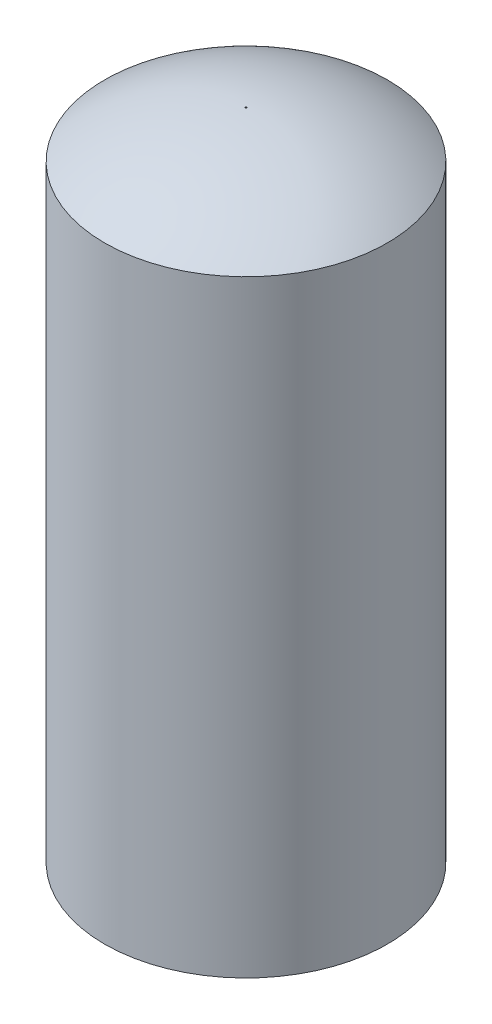
ISO-10303-21;
HEADER;
FILE_DESCRIPTION(('STEP AP214'),'2;1');
FILE_NAME('part.step','',(''),(''),'','','');
FILE_SCHEMA(('AUTOMOTIVE_DESIGN { 1 0 10303 214 1 1 1 1 }'));
ENDSEC;
DATA;
#1=APPLICATION_CONTEXT('core data for automotive mechanical design processes');
#2=APPLICATION_PROTOCOL_DEFINITION('international standard','automotive_design',2000,#1);
#3=PRODUCT_CONTEXT('',#1,'mechanical');
#4=PRODUCT('Part','Part','',(#3));
#5=PRODUCT_RELATED_PRODUCT_CATEGORY('part','',(#4));
#6=PRODUCT_DEFINITION_FORMATION('','',#4);
#7=PRODUCT_DEFINITION_CONTEXT('part definition',#1,'design');
#8=PRODUCT_DEFINITION('design','',#6,#7);
#9=PRODUCT_DEFINITION_SHAPE('','',#8);
#10=(LENGTH_UNIT() NAMED_UNIT(*) SI_UNIT(.MILLI.,.METRE.));
#11=(NAMED_UNIT(*) PLANE_ANGLE_UNIT() SI_UNIT($,.RADIAN.));
#12=(NAMED_UNIT(*) SI_UNIT($,.STERADIAN.) SOLID_ANGLE_UNIT());
#13=UNCERTAINTY_MEASURE_WITH_UNIT(LENGTH_MEASURE(1.E-05),#10,'distance_accuracy_value','');
#14=(GEOMETRIC_REPRESENTATION_CONTEXT(3) GLOBAL_UNCERTAINTY_ASSIGNED_CONTEXT((#13)) GLOBAL_UNIT_ASSIGNED_CONTEXT((#10,
#11,#12)) REPRESENTATION_CONTEXT('',''));
#15=CARTESIAN_POINT('',(0.,0.,0.));
#16=DIRECTION('',(0.,0.,1.));
#17=DIRECTION('',(1.,0.,0.));
#18=AXIS2_PLACEMENT_3D('',#15,#16,#17);
#19=CARTESIAN_POINT('',(0.,336.822120741722,0.));
#20=DIRECTION('',(0.,-1.,0.));
#21=DIRECTION('',(0.,0.,-1.));
#22=AXIS2_PLACEMENT_3D('',#19,#20,#21);
#23=DEGENERATE_TOROIDAL_SURFACE('',#22,0.499999999965306,336.822491857285,.T.);
#24=CARTESIAN_POINT('',(0.,0.,0.));
#25=DIRECTION('',(0.,-1.,0.));
#26=DIRECTION('',(0.,0.,-1.));
#27=AXIS2_PLACEMENT_3D('',#24,#25,#26);
#28=CIRCLE('',#27,0.999999999999753);
#29=CARTESIAN_POINT('',(0.,0.,-0.999999999999753));
#30=VERTEX_POINT('',#29);
#31=EDGE_CURVE('E61',#30,#30,#28,.T.);
#32=ORIENTED_EDGE('',*,*,#31,.T.);
#33=EDGE_LOOP('',(#32));
#34=FACE_BOUND('',#33,.T.);
#35=CARTESIAN_POINT('',(0.,65.4383684260438,0.));
#36=DIRECTION('',(0.,-1.,0.));
#37=DIRECTION('',(0.,0.,-1.));
#38=AXIS2_PLACEMENT_3D('',#35,#36,#37);
#39=CIRCLE('',#38,200.);
#40=CARTESIAN_POINT('',(0.,65.4383684260438,-200.));
#41=VERTEX_POINT('',#40);
#42=EDGE_CURVE('E10',#41,#41,#39,.T.);
#43=ORIENTED_EDGE('',*,*,#42,.F.);
#44=EDGE_LOOP('',(#43));
#45=FACE_BOUND('',#44,.T.);
#46=ADVANCED_FACE('F33',(#34,#45),#23,.F.);
#47=CARTESIAN_POINT('',(0.,-42.7351370897731,0.));
#48=DIRECTION('',(0.,-1.,0.));
#49=DIRECTION('',(0.,0.,-1.));
#50=AXIS2_PLACEMENT_3D('',#47,#48,#49);
#51=CYLINDRICAL_SURFACE('',#50,200.);
#52=ORIENTED_EDGE('',*,*,#42,.T.);
#53=EDGE_LOOP('',(#52));
#54=FACE_BOUND('',#53,.T.);
#55=CARTESIAN_POINT('',(0.,934.561631573956,0.));
#56=DIRECTION('',(0.,-1.,0.));
#57=DIRECTION('',(0.,0.,-1.));
#58=AXIS2_PLACEMENT_3D('',#55,#56,#57);
#59=CIRCLE('',#58,200.);
#60=CARTESIAN_POINT('',(0.,934.561631573956,-200.));
#61=VERTEX_POINT('',#60);
#62=EDGE_CURVE('E39',#61,#61,#59,.T.);
#63=ORIENTED_EDGE('',*,*,#62,.F.);
#64=EDGE_LOOP('',(#63));
#65=FACE_BOUND('',#64,.T.);
#66=ADVANCED_FACE('F99',(#54,#65),#51,.F.);
#67=CARTESIAN_POINT('',(0.,663.177879258278,0.));
#68=DIRECTION('',(0.,-1.,0.));
#69=DIRECTION('',(0.,0.,-1.));
#70=AXIS2_PLACEMENT_3D('',#67,#68,#69);
#71=DEGENERATE_TOROIDAL_SURFACE('',#70,0.499999999965306,336.822491857285,.T.);
#72=ORIENTED_EDGE('',*,*,#62,.T.);
#73=EDGE_LOOP('',(#72));
#74=FACE_BOUND('',#73,.T.);
#75=CARTESIAN_POINT('',(0.,1000.,0.));
#76=DIRECTION('',(0.,-1.,0.));
#77=DIRECTION('',(0.,0.,-1.));
#78=AXIS2_PLACEMENT_3D('',#75,#76,#77);
#79=CIRCLE('',#78,1.00000000000002);
#80=CARTESIAN_POINT('',(0.,1000.,-1.00000000000002));
#81=VERTEX_POINT('',#80);
#82=EDGE_CURVE('E43',#81,#81,#79,.T.);
#83=ORIENTED_EDGE('',*,*,#82,.F.);
#84=EDGE_LOOP('',(#83));
#85=FACE_BOUND('',#84,.T.);
#86=ADVANCED_FACE('F94',(#74,#85),#71,.F.);
#87=CARTESIAN_POINT('',(0.,1000.,0.));
#88=DIRECTION('',(0.,1.,0.));
#89=DIRECTION('',(0.,0.,1.));
#90=AXIS2_PLACEMENT_3D('',#87,#88,#89);
#91=CONICAL_SURFACE('',#90,1.00000000000002,0.00148446198147125);
#92=CARTESIAN_POINT('',(0.,1002.99999669456,0.));
#93=DIRECTION('',(0.,-1.,0.));
#94=DIRECTION('',(0.,0.,-1.));
#95=AXIS2_PLACEMENT_3D('',#92,#93,#94);
#96=CIRCLE('',#95,1.00445338430883);
#97=CARTESIAN_POINT('',(0.,1002.99999669456,-1.00445338430883));
#98=VERTEX_POINT('',#97);
#99=EDGE_CURVE('E47',#98,#98,#96,.T.);
#100=ORIENTED_EDGE('',*,*,#99,.F.);
#101=EDGE_LOOP('',(#100));
#102=FACE_BOUND('',#101,.T.);
#103=ORIENTED_EDGE('',*,*,#82,.T.);
#104=EDGE_LOOP('',(#103));
#105=FACE_BOUND('',#104,.T.);
#106=ADVANCED_FACE('F88',(#102,#105),#91,.F.);
#107=CARTESIAN_POINT('',(0.,663.177879258278,0.));
#108=DIRECTION('',(0.,-1.,0.));
#109=DIRECTION('',(0.,0.,-1.));
#110=AXIS2_PLACEMENT_3D('',#107,#108,#109);
#111=DEGENERATE_TOROIDAL_SURFACE('',#110,0.499999999965306,339.822491857285,.T.);
#112=CARTESIAN_POINT('',(0.,936.075435077455,0.));
#113=DIRECTION('',(0.,-1.,0.));
#114=DIRECTION('',(0.,0.,-1.));
#115=AXIS2_PLACEMENT_3D('',#112,#113,#114);
#116=CIRCLE('',#115,203.);
#117=CARTESIAN_POINT('',(0.,936.075435077455,-203.));
#118=VERTEX_POINT('',#117);
#119=EDGE_CURVE('E52',#118,#118,#116,.T.);
#120=ORIENTED_EDGE('',*,*,#119,.F.);
#121=EDGE_LOOP('',(#120));
#122=FACE_BOUND('',#121,.T.);
#123=ORIENTED_EDGE('',*,*,#99,.T.);
#124=EDGE_LOOP('',(#123));
#125=FACE_BOUND('',#124,.T.);
#126=ADVANCED_FACE('F82',(#122,#125),#111,.T.);
#127=CARTESIAN_POINT('',(0.,-42.7351370897731,0.));
#128=DIRECTION('',(0.,-1.,0.));
#129=DIRECTION('',(0.,0.,-1.));
#130=AXIS2_PLACEMENT_3D('',#127,#128,#129);
#131=CYLINDRICAL_SURFACE('',#130,203.);
#132=CARTESIAN_POINT('',(0.,63.924564922545,0.));
#133=DIRECTION('',(0.,-1.,0.));
#134=DIRECTION('',(0.,0.,-1.));
#135=AXIS2_PLACEMENT_3D('',#132,#133,#134);
#136=CIRCLE('',#135,203.);
#137=CARTESIAN_POINT('',(0.,63.924564922545,-203.));
#138=VERTEX_POINT('',#137);
#139=EDGE_CURVE('E55',#138,#138,#136,.T.);
#140=ORIENTED_EDGE('',*,*,#139,.F.);
#141=EDGE_LOOP('',(#140));
#142=FACE_BOUND('',#141,.T.);
#143=ORIENTED_EDGE('',*,*,#119,.T.);
#144=EDGE_LOOP('',(#143));
#145=FACE_BOUND('',#144,.T.);
#146=ADVANCED_FACE('F76',(#142,#145),#131,.T.);
#147=CARTESIAN_POINT('',(0.,336.822120741722,0.));
#148=DIRECTION('',(0.,-1.,0.));
#149=DIRECTION('',(0.,0.,-1.));
#150=AXIS2_PLACEMENT_3D('',#147,#148,#149);
#151=DEGENERATE_TOROIDAL_SURFACE('',#150,0.499999999965306,339.822491857285,.T.);
#152=CARTESIAN_POINT('',(0.,-2.99999669455964,0.));
#153=DIRECTION('',(0.,-1.,0.));
#154=DIRECTION('',(0.,0.,-1.));
#155=AXIS2_PLACEMENT_3D('',#152,#153,#154);
#156=CIRCLE('',#155,1.0044533843086);
#157=CARTESIAN_POINT('',(0.,-2.99999669455964,-1.0044533843086));
#158=VERTEX_POINT('',#157);
#159=EDGE_CURVE('E58',#158,#158,#156,.T.);
#160=ORIENTED_EDGE('',*,*,#159,.F.);
#161=EDGE_LOOP('',(#160));
#162=FACE_BOUND('',#161,.T.);
#163=ORIENTED_EDGE('',*,*,#139,.T.);
#164=EDGE_LOOP('',(#163));
#165=FACE_BOUND('',#164,.T.);
#166=ADVANCED_FACE('F70',(#162,#165),#151,.T.);
#167=CARTESIAN_POINT('',(0.,-2.99999669455964,0.));
#168=DIRECTION('',(0.,-1.,0.));
#169=DIRECTION('',(0.,0.,-1.));
#170=AXIS2_PLACEMENT_3D('',#167,#168,#169);
#171=CONICAL_SURFACE('',#170,1.0044533843086,0.00148446198148181);
#172=ORIENTED_EDGE('',*,*,#31,.F.);
#173=EDGE_LOOP('',(#172));
#174=FACE_BOUND('',#173,.T.);
#175=ORIENTED_EDGE('',*,*,#159,.T.);
#176=EDGE_LOOP('',(#175));
#177=FACE_BOUND('',#176,.T.);
#178=ADVANCED_FACE('F67',(#174,#177),#171,.F.);
#179=CLOSED_SHELL('',(#46,#66,#86,#106,#126,#146,#166,#178));
#180=MANIFOLD_SOLID_BREP('B2',#179);
#181=ADVANCED_BREP_SHAPE_REPRESENTATION('',(#18,#180),#14);
#182=SHAPE_DEFINITION_REPRESENTATION(#9,#181);
ENDSEC;
END-ISO-10303-21;
